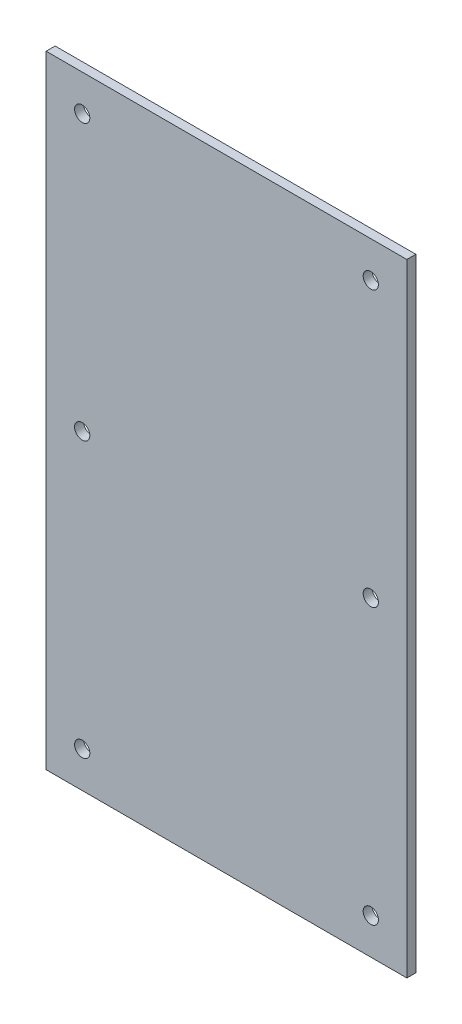
ISO-10303-21;
HEADER;
FILE_DESCRIPTION(('STEP AP214'),'2;1');
FILE_NAME('part.step','',(''),(''),'','','');
FILE_SCHEMA(('AUTOMOTIVE_DESIGN { 1 0 10303 214 1 1 1 1 }'));
ENDSEC;
DATA;
#1=APPLICATION_CONTEXT('core data for automotive mechanical design processes');
#2=APPLICATION_PROTOCOL_DEFINITION('international standard','automotive_design',2000,#1);
#3=PRODUCT_CONTEXT('',#1,'mechanical');
#4=PRODUCT('Part','Part','',(#3));
#5=PRODUCT_RELATED_PRODUCT_CATEGORY('part','',(#4));
#6=PRODUCT_DEFINITION_FORMATION('','',#4);
#7=PRODUCT_DEFINITION_CONTEXT('part definition',#1,'design');
#8=PRODUCT_DEFINITION('design','',#6,#7);
#9=PRODUCT_DEFINITION_SHAPE('','',#8);
#10=(LENGTH_UNIT() NAMED_UNIT(*) SI_UNIT(.MILLI.,.METRE.));
#11=(NAMED_UNIT(*) PLANE_ANGLE_UNIT() SI_UNIT($,.RADIAN.));
#12=(NAMED_UNIT(*) SI_UNIT($,.STERADIAN.) SOLID_ANGLE_UNIT());
#13=UNCERTAINTY_MEASURE_WITH_UNIT(LENGTH_MEASURE(1.E-05),#10,'distance_accuracy_value','');
#14=(GEOMETRIC_REPRESENTATION_CONTEXT(3) GLOBAL_UNCERTAINTY_ASSIGNED_CONTEXT((#13)) GLOBAL_UNIT_ASSIGNED_CONTEXT((#10,
#11,#12)) REPRESENTATION_CONTEXT('',''));
#15=CARTESIAN_POINT('',(0.,0.,0.));
#16=DIRECTION('',(0.,0.,1.));
#17=DIRECTION('',(1.,0.,0.));
#18=AXIS2_PLACEMENT_3D('',#15,#16,#17);
#19=CARTESIAN_POINT('',(127.,219.075,6.35));
#20=DIRECTION('',(-1.,0.,0.));
#21=DIRECTION('',(0.,-1.,0.));
#22=AXIS2_PLACEMENT_3D('',#19,#20,#21);
#23=PLANE('',#22);
#24=DIRECTION('',(0.,1.,0.));
#25=VECTOR('',#24,1.);
#26=CARTESIAN_POINT('',(127.,219.075,0.));
#27=LINE('',#26,#25);
#28=CARTESIAN_POINT('',(127.,-219.075,0.));
#29=VERTEX_POINT('',#28);
#30=CARTESIAN_POINT('',(127.,219.075,0.));
#31=VERTEX_POINT('',#30);
#32=EDGE_CURVE('E97',#29,#31,#27,.T.);
#33=ORIENTED_EDGE('',*,*,#32,.T.);
#34=DIRECTION('',(0.,0.,-1.));
#35=VECTOR('',#34,1.);
#36=CARTESIAN_POINT('',(127.,219.075,6.35));
#37=LINE('',#36,#35);
#38=CARTESIAN_POINT('',(127.,219.075,6.35));
#39=VERTEX_POINT('',#38);
#40=EDGE_CURVE('E11',#39,#31,#37,.T.);
#41=ORIENTED_EDGE('',*,*,#40,.F.);
#42=DIRECTION('',(0.,1.,0.));
#43=VECTOR('',#42,1.);
#44=CARTESIAN_POINT('',(127.,219.075,6.35));
#45=LINE('',#44,#43);
#46=CARTESIAN_POINT('',(127.,-219.075,6.35));
#47=VERTEX_POINT('',#46);
#48=EDGE_CURVE('E85',#47,#39,#45,.T.);
#49=ORIENTED_EDGE('',*,*,#48,.F.);
#50=DIRECTION('',(0.,0.,-1.));
#51=VECTOR('',#50,1.);
#52=CARTESIAN_POINT('',(127.,-219.075,6.35));
#53=LINE('',#52,#51);
#54=EDGE_CURVE('E93',#47,#29,#53,.T.);
#55=ORIENTED_EDGE('',*,*,#54,.T.);
#56=EDGE_LOOP('',(#33,#41,#49,#55));
#57=FACE_BOUND('',#56,.T.);
#58=ADVANCED_FACE('F34',(#57),#23,.F.);
#59=CARTESIAN_POINT('',(-127.,219.075,6.35));
#60=DIRECTION('',(0.,-1.,0.));
#61=DIRECTION('',(0.,0.,-1.));
#62=AXIS2_PLACEMENT_3D('',#59,#60,#61);
#63=PLANE('',#62);
#64=DIRECTION('',(-1.,0.,0.));
#65=VECTOR('',#64,1.);
#66=CARTESIAN_POINT('',(-127.,219.075,0.));
#67=LINE('',#66,#65);
#68=CARTESIAN_POINT('',(-127.,219.075,0.));
#69=VERTEX_POINT('',#68);
#70=EDGE_CURVE('E89',#31,#69,#67,.T.);
#71=ORIENTED_EDGE('',*,*,#70,.T.);
#72=DIRECTION('',(0.,0.,-1.));
#73=VECTOR('',#72,1.);
#74=CARTESIAN_POINT('',(-127.,219.075,6.35));
#75=LINE('',#74,#73);
#76=CARTESIAN_POINT('',(-127.,219.075,6.35));
#77=VERTEX_POINT('',#76);
#78=EDGE_CURVE('E42',#77,#69,#75,.T.);
#79=ORIENTED_EDGE('',*,*,#78,.F.);
#80=DIRECTION('',(-1.,0.,0.));
#81=VECTOR('',#80,1.);
#82=CARTESIAN_POINT('',(-127.,219.075,6.35));
#83=LINE('',#82,#81);
#84=EDGE_CURVE('E80',#39,#77,#83,.T.);
#85=ORIENTED_EDGE('',*,*,#84,.F.);
#86=ORIENTED_EDGE('',*,*,#40,.T.);
#87=EDGE_LOOP('',(#71,#79,#85,#86));
#88=FACE_BOUND('',#87,.T.);
#89=ADVANCED_FACE('F88',(#88),#63,.F.);
#90=CARTESIAN_POINT('',(-127.,219.075,6.35));
#91=DIRECTION('',(1.,0.,0.));
#92=DIRECTION('',(0.,1.,0.));
#93=AXIS2_PLACEMENT_3D('',#90,#91,#92);
#94=PLANE('',#93);
#95=DIRECTION('',(0.,-1.,0.));
#96=VECTOR('',#95,1.);
#97=CARTESIAN_POINT('',(-127.,219.075,0.));
#98=LINE('',#97,#96);
#99=CARTESIAN_POINT('',(-127.,-219.075,0.));
#100=VERTEX_POINT('',#99);
#101=EDGE_CURVE('E67',#69,#100,#98,.T.);
#102=ORIENTED_EDGE('',*,*,#101,.T.);
#103=DIRECTION('',(0.,0.,-1.));
#104=VECTOR('',#103,1.);
#105=CARTESIAN_POINT('',(-127.,-219.075,6.35));
#106=LINE('',#105,#104);
#107=CARTESIAN_POINT('',(-127.,-219.075,6.35));
#108=VERTEX_POINT('',#107);
#109=EDGE_CURVE('E90',#108,#100,#106,.T.);
#110=ORIENTED_EDGE('',*,*,#109,.F.);
#111=DIRECTION('',(0.,-1.,0.));
#112=VECTOR('',#111,1.);
#113=CARTESIAN_POINT('',(-127.,219.075,6.35));
#114=LINE('',#113,#112);
#115=EDGE_CURVE('E83',#77,#108,#114,.T.);
#116=ORIENTED_EDGE('',*,*,#115,.F.);
#117=ORIENTED_EDGE('',*,*,#78,.T.);
#118=EDGE_LOOP('',(#102,#110,#116,#117));
#119=FACE_BOUND('',#118,.T.);
#120=ADVANCED_FACE('F91',(#119),#94,.F.);
#121=CARTESIAN_POINT('',(-127.,-219.075,6.35));
#122=DIRECTION('',(0.,1.,0.));
#123=DIRECTION('',(0.,0.,1.));
#124=AXIS2_PLACEMENT_3D('',#121,#122,#123);
#125=PLANE('',#124);
#126=DIRECTION('',(1.,0.,0.));
#127=VECTOR('',#126,1.);
#128=CARTESIAN_POINT('',(-127.,-219.075,0.));
#129=LINE('',#128,#127);
#130=EDGE_CURVE('E73',#100,#29,#129,.T.);
#131=ORIENTED_EDGE('',*,*,#130,.T.);
#132=ORIENTED_EDGE('',*,*,#54,.F.);
#133=DIRECTION('',(1.,0.,0.));
#134=VECTOR('',#133,1.);
#135=CARTESIAN_POINT('',(-127.,-219.075,6.35));
#136=LINE('',#135,#134);
#137=EDGE_CURVE('E50',#108,#47,#136,.T.);
#138=ORIENTED_EDGE('',*,*,#137,.F.);
#139=ORIENTED_EDGE('',*,*,#109,.T.);
#140=EDGE_LOOP('',(#131,#132,#138,#139));
#141=FACE_BOUND('',#140,.T.);
#142=ADVANCED_FACE('F105',(#141),#125,.F.);
#143=CARTESIAN_POINT('',(0.,0.,6.35));
#144=DIRECTION('',(0.,0.,1.));
#145=DIRECTION('',(1.,0.,0.));
#146=AXIS2_PLACEMENT_3D('',#143,#144,#145);
#147=PLANE('',#146);
#148=CARTESIAN_POINT('',(-101.6,193.675,6.35));
#149=DIRECTION('',(0.,0.,1.));
#150=DIRECTION('',(1.,0.,0.));
#151=AXIS2_PLACEMENT_3D('',#148,#149,#150);
#152=CIRCLE('',#151,5.357876);
#153=CARTESIAN_POINT('',(-96.242124,193.675,6.35));
#154=VERTEX_POINT('',#153);
#155=EDGE_CURVE('E143',#154,#154,#152,.T.);
#156=ORIENTED_EDGE('',*,*,#155,.F.);
#157=EDGE_LOOP('',(#156));
#158=FACE_BOUND('',#157,.T.);
#159=CARTESIAN_POINT('',(-101.6,0.,6.35));
#160=DIRECTION('',(0.,0.,1.));
#161=DIRECTION('',(1.,0.,0.));
#162=AXIS2_PLACEMENT_3D('',#159,#160,#161);
#163=CIRCLE('',#162,5.357876);
#164=CARTESIAN_POINT('',(-96.242124,0.,6.35));
#165=VERTEX_POINT('',#164);
#166=EDGE_CURVE('E137',#165,#165,#163,.T.);
#167=ORIENTED_EDGE('',*,*,#166,.F.);
#168=EDGE_LOOP('',(#167));
#169=FACE_BOUND('',#168,.T.);
#170=CARTESIAN_POINT('',(-101.6,-193.675,6.35));
#171=DIRECTION('',(0.,0.,1.));
#172=DIRECTION('',(1.,0.,0.));
#173=AXIS2_PLACEMENT_3D('',#170,#171,#172);
#174=CIRCLE('',#173,5.357876);
#175=CARTESIAN_POINT('',(-96.242124,-193.675,6.35));
#176=VERTEX_POINT('',#175);
#177=EDGE_CURVE('E131',#176,#176,#174,.T.);
#178=ORIENTED_EDGE('',*,*,#177,.F.);
#179=EDGE_LOOP('',(#178));
#180=FACE_BOUND('',#179,.T.);
#181=CARTESIAN_POINT('',(101.6,193.675,6.35));
#182=DIRECTION('',(0.,0.,1.));
#183=DIRECTION('',(1.,0.,0.));
#184=AXIS2_PLACEMENT_3D('',#181,#182,#183);
#185=CIRCLE('',#184,5.357876);
#186=CARTESIAN_POINT('',(106.957876,193.675,6.35));
#187=VERTEX_POINT('',#186);
#188=EDGE_CURVE('E125',#187,#187,#185,.T.);
#189=ORIENTED_EDGE('',*,*,#188,.F.);
#190=EDGE_LOOP('',(#189));
#191=FACE_BOUND('',#190,.T.);
#192=CARTESIAN_POINT('',(101.6,0.,6.35));
#193=DIRECTION('',(0.,0.,1.));
#194=DIRECTION('',(1.,0.,0.));
#195=AXIS2_PLACEMENT_3D('',#192,#193,#194);
#196=CIRCLE('',#195,5.357876);
#197=CARTESIAN_POINT('',(106.957876,0.,6.35));
#198=VERTEX_POINT('',#197);
#199=EDGE_CURVE('E119',#198,#198,#196,.T.);
#200=ORIENTED_EDGE('',*,*,#199,.F.);
#201=EDGE_LOOP('',(#200));
#202=FACE_BOUND('',#201,.T.);
#203=CARTESIAN_POINT('',(101.6,-193.675,6.35));
#204=DIRECTION('',(0.,0.,1.));
#205=DIRECTION('',(1.,0.,0.));
#206=AXIS2_PLACEMENT_3D('',#203,#204,#205);
#207=CIRCLE('',#206,5.357876);
#208=CARTESIAN_POINT('',(106.957876,-193.675,6.35));
#209=VERTEX_POINT('',#208);
#210=EDGE_CURVE('E113',#209,#209,#207,.T.);
#211=ORIENTED_EDGE('',*,*,#210,.F.);
#212=EDGE_LOOP('',(#211));
#213=FACE_BOUND('',#212,.T.);
#214=ORIENTED_EDGE('',*,*,#48,.T.);
#215=ORIENTED_EDGE('',*,*,#84,.T.);
#216=ORIENTED_EDGE('',*,*,#115,.T.);
#217=ORIENTED_EDGE('',*,*,#137,.T.);
#218=EDGE_LOOP('',(#214,#215,#216,#217));
#219=FACE_BOUND('',#218,.T.);
#220=ADVANCED_FACE('F81',(#158,#169,#180,#191,#202,#213,#219),#147,.T.);
#221=CARTESIAN_POINT('',(0.,0.,0.));
#222=DIRECTION('',(0.,0.,1.));
#223=DIRECTION('',(1.,0.,0.));
#224=AXIS2_PLACEMENT_3D('',#221,#222,#223);
#225=PLANE('',#224);
#226=CARTESIAN_POINT('',(-101.6,193.675,0.));
#227=DIRECTION('',(0.,0.,1.));
#228=DIRECTION('',(1.,0.,0.));
#229=AXIS2_PLACEMENT_3D('',#226,#227,#228);
#230=CIRCLE('',#229,5.357876);
#231=CARTESIAN_POINT('',(-96.242124,193.675,0.));
#232=VERTEX_POINT('',#231);
#233=EDGE_CURVE('E140',#232,#232,#230,.T.);
#234=ORIENTED_EDGE('',*,*,#233,.T.);
#235=EDGE_LOOP('',(#234));
#236=FACE_BOUND('',#235,.T.);
#237=CARTESIAN_POINT('',(-101.6,0.,0.));
#238=DIRECTION('',(0.,0.,1.));
#239=DIRECTION('',(1.,0.,0.));
#240=AXIS2_PLACEMENT_3D('',#237,#238,#239);
#241=CIRCLE('',#240,5.357876);
#242=CARTESIAN_POINT('',(-96.242124,0.,0.));
#243=VERTEX_POINT('',#242);
#244=EDGE_CURVE('E134',#243,#243,#241,.T.);
#245=ORIENTED_EDGE('',*,*,#244,.T.);
#246=EDGE_LOOP('',(#245));
#247=FACE_BOUND('',#246,.T.);
#248=CARTESIAN_POINT('',(-101.6,-193.675,0.));
#249=DIRECTION('',(0.,0.,1.));
#250=DIRECTION('',(1.,0.,0.));
#251=AXIS2_PLACEMENT_3D('',#248,#249,#250);
#252=CIRCLE('',#251,5.357876);
#253=CARTESIAN_POINT('',(-96.242124,-193.675,0.));
#254=VERTEX_POINT('',#253);
#255=EDGE_CURVE('E128',#254,#254,#252,.T.);
#256=ORIENTED_EDGE('',*,*,#255,.T.);
#257=EDGE_LOOP('',(#256));
#258=FACE_BOUND('',#257,.T.);
#259=CARTESIAN_POINT('',(101.6,193.675,0.));
#260=DIRECTION('',(0.,0.,1.));
#261=DIRECTION('',(1.,0.,0.));
#262=AXIS2_PLACEMENT_3D('',#259,#260,#261);
#263=CIRCLE('',#262,5.357876);
#264=CARTESIAN_POINT('',(106.957876,193.675,0.));
#265=VERTEX_POINT('',#264);
#266=EDGE_CURVE('E122',#265,#265,#263,.T.);
#267=ORIENTED_EDGE('',*,*,#266,.T.);
#268=EDGE_LOOP('',(#267));
#269=FACE_BOUND('',#268,.T.);
#270=CARTESIAN_POINT('',(101.6,0.,0.));
#271=DIRECTION('',(0.,0.,1.));
#272=DIRECTION('',(1.,0.,0.));
#273=AXIS2_PLACEMENT_3D('',#270,#271,#272);
#274=CIRCLE('',#273,5.357876);
#275=CARTESIAN_POINT('',(106.957876,0.,0.));
#276=VERTEX_POINT('',#275);
#277=EDGE_CURVE('E116',#276,#276,#274,.T.);
#278=ORIENTED_EDGE('',*,*,#277,.T.);
#279=EDGE_LOOP('',(#278));
#280=FACE_BOUND('',#279,.T.);
#281=CARTESIAN_POINT('',(101.6,-193.675,0.));
#282=DIRECTION('',(0.,0.,1.));
#283=DIRECTION('',(1.,0.,0.));
#284=AXIS2_PLACEMENT_3D('',#281,#282,#283);
#285=CIRCLE('',#284,5.357876);
#286=CARTESIAN_POINT('',(106.957876,-193.675,0.));
#287=VERTEX_POINT('',#286);
#288=EDGE_CURVE('E100',#287,#287,#285,.T.);
#289=ORIENTED_EDGE('',*,*,#288,.T.);
#290=EDGE_LOOP('',(#289));
#291=FACE_BOUND('',#290,.T.);
#292=ORIENTED_EDGE('',*,*,#32,.F.);
#293=ORIENTED_EDGE('',*,*,#130,.F.);
#294=ORIENTED_EDGE('',*,*,#101,.F.);
#295=ORIENTED_EDGE('',*,*,#70,.F.);
#296=EDGE_LOOP('',(#292,#293,#294,#295));
#297=FACE_BOUND('',#296,.T.);
#298=ADVANCED_FACE('F108',(#236,#247,#258,#269,#280,#291,#297),#225,.F.);
#299=CARTESIAN_POINT('',(101.6,-193.675,6.35));
#300=DIRECTION('',(0.,0.,1.));
#301=DIRECTION('',(1.,0.,0.));
#302=AXIS2_PLACEMENT_3D('',#299,#300,#301);
#303=CYLINDRICAL_SURFACE('',#302,5.357876);
#304=ORIENTED_EDGE('',*,*,#288,.F.);
#305=EDGE_LOOP('',(#304));
#306=FACE_BOUND('',#305,.T.);
#307=ORIENTED_EDGE('',*,*,#210,.T.);
#308=EDGE_LOOP('',(#307));
#309=FACE_BOUND('',#308,.T.);
#310=ADVANCED_FACE('F162',(#306,#309),#303,.F.);
#311=CARTESIAN_POINT('',(101.6,0.,6.35));
#312=DIRECTION('',(0.,0.,1.));
#313=DIRECTION('',(1.,0.,0.));
#314=AXIS2_PLACEMENT_3D('',#311,#312,#313);
#315=CYLINDRICAL_SURFACE('',#314,5.357876);
#316=ORIENTED_EDGE('',*,*,#277,.F.);
#317=EDGE_LOOP('',(#316));
#318=FACE_BOUND('',#317,.T.);
#319=ORIENTED_EDGE('',*,*,#199,.T.);
#320=EDGE_LOOP('',(#319));
#321=FACE_BOUND('',#320,.T.);
#322=ADVANCED_FACE('F164',(#318,#321),#315,.F.);
#323=CARTESIAN_POINT('',(101.6,193.675,6.35));
#324=DIRECTION('',(0.,0.,1.));
#325=DIRECTION('',(1.,0.,0.));
#326=AXIS2_PLACEMENT_3D('',#323,#324,#325);
#327=CYLINDRICAL_SURFACE('',#326,5.357876);
#328=ORIENTED_EDGE('',*,*,#266,.F.);
#329=EDGE_LOOP('',(#328));
#330=FACE_BOUND('',#329,.T.);
#331=ORIENTED_EDGE('',*,*,#188,.T.);
#332=EDGE_LOOP('',(#331));
#333=FACE_BOUND('',#332,.T.);
#334=ADVANCED_FACE('F171',(#330,#333),#327,.F.);
#335=CARTESIAN_POINT('',(-101.6,-193.675,6.35));
#336=DIRECTION('',(0.,0.,1.));
#337=DIRECTION('',(1.,0.,0.));
#338=AXIS2_PLACEMENT_3D('',#335,#336,#337);
#339=CYLINDRICAL_SURFACE('',#338,5.357876);
#340=ORIENTED_EDGE('',*,*,#255,.F.);
#341=EDGE_LOOP('',(#340));
#342=FACE_BOUND('',#341,.T.);
#343=ORIENTED_EDGE('',*,*,#177,.T.);
#344=EDGE_LOOP('',(#343));
#345=FACE_BOUND('',#344,.T.);
#346=ADVANCED_FACE('F218',(#342,#345),#339,.F.);
#347=CARTESIAN_POINT('',(-101.6,0.,6.35));
#348=DIRECTION('',(0.,0.,1.));
#349=DIRECTION('',(1.,0.,0.));
#350=AXIS2_PLACEMENT_3D('',#347,#348,#349);
#351=CYLINDRICAL_SURFACE('',#350,5.357876);
#352=ORIENTED_EDGE('',*,*,#244,.F.);
#353=EDGE_LOOP('',(#352));
#354=FACE_BOUND('',#353,.T.);
#355=ORIENTED_EDGE('',*,*,#166,.T.);
#356=EDGE_LOOP('',(#355));
#357=FACE_BOUND('',#356,.T.);
#358=ADVANCED_FACE('F228',(#354,#357),#351,.F.);
#359=CARTESIAN_POINT('',(-101.6,193.675,6.35));
#360=DIRECTION('',(0.,0.,1.));
#361=DIRECTION('',(1.,0.,0.));
#362=AXIS2_PLACEMENT_3D('',#359,#360,#361);
#363=CYLINDRICAL_SURFACE('',#362,5.357876);
#364=ORIENTED_EDGE('',*,*,#233,.F.);
#365=EDGE_LOOP('',(#364));
#366=FACE_BOUND('',#365,.T.);
#367=ORIENTED_EDGE('',*,*,#155,.T.);
#368=EDGE_LOOP('',(#367));
#369=FACE_BOUND('',#368,.T.);
#370=ADVANCED_FACE('F147',(#366,#369),#363,.F.);
#371=CLOSED_SHELL('',(#58,#89,#120,#142,#220,#298,#310,#322,#334,#346,#358,#370));
#372=MANIFOLD_SOLID_BREP('B2',#371);
#373=ADVANCED_BREP_SHAPE_REPRESENTATION('',(#18,#372),#14);
#374=SHAPE_DEFINITION_REPRESENTATION(#9,#373);
ENDSEC;
END-ISO-10303-21;
